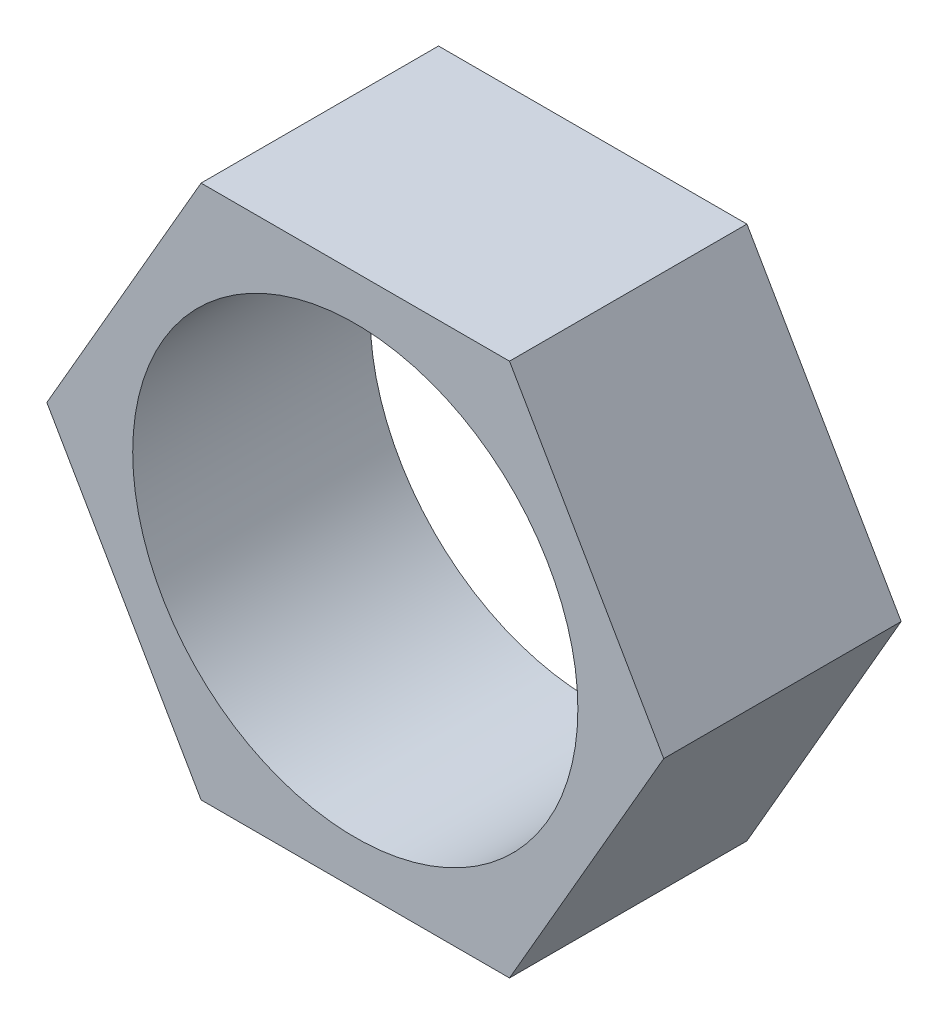
ISO-10303-21;
HEADER;
FILE_DESCRIPTION(('STEP AP214'),'2;1');
FILE_NAME('part.step','',(''),(''),'','','');
FILE_SCHEMA(('AUTOMOTIVE_DESIGN { 1 0 10303 214 1 1 1 1 }'));
ENDSEC;
DATA;
#1=APPLICATION_CONTEXT('core data for automotive mechanical design processes');
#2=APPLICATION_PROTOCOL_DEFINITION('international standard','automotive_design',2000,#1);
#3=PRODUCT_CONTEXT('',#1,'mechanical');
#4=PRODUCT('Part','Part','',(#3));
#5=PRODUCT_RELATED_PRODUCT_CATEGORY('part','',(#4));
#6=PRODUCT_DEFINITION_FORMATION('','',#4);
#7=PRODUCT_DEFINITION_CONTEXT('part definition',#1,'design');
#8=PRODUCT_DEFINITION('design','',#6,#7);
#9=PRODUCT_DEFINITION_SHAPE('','',#8);
#10=(LENGTH_UNIT() NAMED_UNIT(*) SI_UNIT(.MILLI.,.METRE.));
#11=(NAMED_UNIT(*) PLANE_ANGLE_UNIT() SI_UNIT($,.RADIAN.));
#12=(NAMED_UNIT(*) SI_UNIT($,.STERADIAN.) SOLID_ANGLE_UNIT());
#13=UNCERTAINTY_MEASURE_WITH_UNIT(LENGTH_MEASURE(1.E-05),#10,'distance_accuracy_value','');
#14=(GEOMETRIC_REPRESENTATION_CONTEXT(3) GLOBAL_UNCERTAINTY_ASSIGNED_CONTEXT((#13)) GLOBAL_UNIT_ASSIGNED_CONTEXT((#10,
#11,#12)) REPRESENTATION_CONTEXT('',''));
#15=CARTESIAN_POINT('',(0.,0.,0.));
#16=DIRECTION('',(0.,0.,1.));
#17=DIRECTION('',(1.,0.,0.));
#18=AXIS2_PLACEMENT_3D('',#15,#16,#17);
#19=CARTESIAN_POINT('',(51.9615242270663,-90.,80.));
#20=DIRECTION('',(-0.866025403784439,0.5,0.));
#21=DIRECTION('',(-0.5,-0.866025403784439,0.));
#22=AXIS2_PLACEMENT_3D('',#19,#20,#21);
#23=PLANE('',#22);
#24=DIRECTION('',(0.5,0.866025403784439,0.));
#25=VECTOR('',#24,1.);
#26=CARTESIAN_POINT('',(51.9615242270663,-90.,0.));
#27=LINE('',#26,#25);
#28=CARTESIAN_POINT('',(51.9615242270663,-90.,0.));
#29=VERTEX_POINT('',#28);
#30=CARTESIAN_POINT('',(103.923048454133,0.,0.));
#31=VERTEX_POINT('',#30);
#32=EDGE_CURVE('E117',#29,#31,#27,.T.);
#33=ORIENTED_EDGE('',*,*,#32,.T.);
#34=DIRECTION('',(0.,0.,-1.));
#35=VECTOR('',#34,1.);
#36=CARTESIAN_POINT('',(103.923048454133,0.,80.));
#37=LINE('',#36,#35);
#38=CARTESIAN_POINT('',(103.923048454133,0.,80.));
#39=VERTEX_POINT('',#38);
#40=EDGE_CURVE('E11',#39,#31,#37,.T.);
#41=ORIENTED_EDGE('',*,*,#40,.F.);
#42=DIRECTION('',(0.5,0.866025403784439,0.));
#43=VECTOR('',#42,1.);
#44=CARTESIAN_POINT('',(51.9615242270663,-90.,80.));
#45=LINE('',#44,#43);
#46=CARTESIAN_POINT('',(51.9615242270663,-90.,80.));
#47=VERTEX_POINT('',#46);
#48=EDGE_CURVE('E128',#47,#39,#45,.T.);
#49=ORIENTED_EDGE('',*,*,#48,.F.);
#50=DIRECTION('',(0.,0.,-1.));
#51=VECTOR('',#50,1.);
#52=CARTESIAN_POINT('',(51.9615242270663,-90.,80.));
#53=LINE('',#52,#51);
#54=EDGE_CURVE('E113',#47,#29,#53,.T.);
#55=ORIENTED_EDGE('',*,*,#54,.T.);
#56=EDGE_LOOP('',(#33,#41,#49,#55));
#57=FACE_BOUND('',#56,.T.);
#58=ADVANCED_FACE('F33',(#57),#23,.F.);
#59=CARTESIAN_POINT('',(103.923048454133,0.,80.));
#60=DIRECTION('',(-0.866025403784439,-0.5,0.));
#61=DIRECTION('',(0.5,-0.866025403784439,0.));
#62=AXIS2_PLACEMENT_3D('',#59,#60,#61);
#63=PLANE('',#62);
#64=DIRECTION('',(-0.5,0.866025403784439,0.));
#65=VECTOR('',#64,1.);
#66=CARTESIAN_POINT('',(103.923048454133,0.,0.));
#67=LINE('',#66,#65);
#68=CARTESIAN_POINT('',(51.9615242270663,90.,0.));
#69=VERTEX_POINT('',#68);
#70=EDGE_CURVE('E120',#31,#69,#67,.T.);
#71=ORIENTED_EDGE('',*,*,#70,.T.);
#72=DIRECTION('',(0.,0.,-1.));
#73=VECTOR('',#72,1.);
#74=CARTESIAN_POINT('',(51.9615242270663,90.,80.));
#75=LINE('',#74,#73);
#76=CARTESIAN_POINT('',(51.9615242270663,90.,80.));
#77=VERTEX_POINT('',#76);
#78=EDGE_CURVE('E41',#77,#69,#75,.T.);
#79=ORIENTED_EDGE('',*,*,#78,.F.);
#80=DIRECTION('',(-0.5,0.866025403784439,0.));
#81=VECTOR('',#80,1.);
#82=CARTESIAN_POINT('',(103.923048454133,0.,80.));
#83=LINE('',#82,#81);
#84=EDGE_CURVE('E86',#39,#77,#83,.T.);
#85=ORIENTED_EDGE('',*,*,#84,.F.);
#86=ORIENTED_EDGE('',*,*,#40,.T.);
#87=EDGE_LOOP('',(#71,#79,#85,#86));
#88=FACE_BOUND('',#87,.T.);
#89=ADVANCED_FACE('F153',(#88),#63,.F.);
#90=CARTESIAN_POINT('',(51.9615242270663,90.,80.));
#91=DIRECTION('',(0.,-1.,0.));
#92=DIRECTION('',(0.,0.,-1.));
#93=AXIS2_PLACEMENT_3D('',#90,#91,#92);
#94=PLANE('',#93);
#95=DIRECTION('',(-1.,0.,0.));
#96=VECTOR('',#95,1.);
#97=CARTESIAN_POINT('',(51.9615242270663,90.,0.));
#98=LINE('',#97,#96);
#99=CARTESIAN_POINT('',(-51.9615242270663,90.,0.));
#100=VERTEX_POINT('',#99);
#101=EDGE_CURVE('E123',#69,#100,#98,.T.);
#102=ORIENTED_EDGE('',*,*,#101,.T.);
#103=DIRECTION('',(0.,0.,-1.));
#104=VECTOR('',#103,1.);
#105=CARTESIAN_POINT('',(-51.9615242270663,90.,80.));
#106=LINE('',#105,#104);
#107=CARTESIAN_POINT('',(-51.9615242270663,90.,80.));
#108=VERTEX_POINT('',#107);
#109=EDGE_CURVE('E108',#108,#100,#106,.T.);
#110=ORIENTED_EDGE('',*,*,#109,.F.);
#111=DIRECTION('',(-1.,0.,0.));
#112=VECTOR('',#111,1.);
#113=CARTESIAN_POINT('',(51.9615242270663,90.,80.));
#114=LINE('',#113,#112);
#115=EDGE_CURVE('E99',#77,#108,#114,.T.);
#116=ORIENTED_EDGE('',*,*,#115,.F.);
#117=ORIENTED_EDGE('',*,*,#78,.T.);
#118=EDGE_LOOP('',(#102,#110,#116,#117));
#119=FACE_BOUND('',#118,.T.);
#120=ADVANCED_FACE('F134',(#119),#94,.F.);
#121=CARTESIAN_POINT('',(-51.9615242270663,90.,80.));
#122=DIRECTION('',(0.866025403784439,-0.5,0.));
#123=DIRECTION('',(0.5,0.866025403784439,0.));
#124=AXIS2_PLACEMENT_3D('',#121,#122,#123);
#125=PLANE('',#124);
#126=DIRECTION('',(-0.5,-0.866025403784439,0.));
#127=VECTOR('',#126,1.);
#128=CARTESIAN_POINT('',(-51.9615242270663,90.,0.));
#129=LINE('',#128,#127);
#130=CARTESIAN_POINT('',(-103.923048454133,0.,0.));
#131=VERTEX_POINT('',#130);
#132=EDGE_CURVE('E107',#100,#131,#129,.T.);
#133=ORIENTED_EDGE('',*,*,#132,.T.);
#134=DIRECTION('',(0.,0.,-1.));
#135=VECTOR('',#134,1.);
#136=CARTESIAN_POINT('',(-103.923048454133,0.,80.));
#137=LINE('',#136,#135);
#138=CARTESIAN_POINT('',(-103.923048454133,0.,80.));
#139=VERTEX_POINT('',#138);
#140=EDGE_CURVE('E104',#139,#131,#137,.T.);
#141=ORIENTED_EDGE('',*,*,#140,.F.);
#142=DIRECTION('',(-0.5,-0.866025403784439,0.));
#143=VECTOR('',#142,1.);
#144=CARTESIAN_POINT('',(-51.9615242270663,90.,80.));
#145=LINE('',#144,#143);
#146=EDGE_CURVE('E93',#108,#139,#145,.T.);
#147=ORIENTED_EDGE('',*,*,#146,.F.);
#148=ORIENTED_EDGE('',*,*,#109,.T.);
#149=EDGE_LOOP('',(#133,#141,#147,#148));
#150=FACE_BOUND('',#149,.T.);
#151=ADVANCED_FACE('F105',(#150),#125,.F.);
#152=CARTESIAN_POINT('',(-103.923048454133,0.,80.));
#153=DIRECTION('',(0.866025403784439,0.5,0.));
#154=DIRECTION('',(-0.5,0.866025403784439,0.));
#155=AXIS2_PLACEMENT_3D('',#152,#153,#154);
#156=PLANE('',#155);
#157=DIRECTION('',(0.5,-0.866025403784439,0.));
#158=VECTOR('',#157,1.);
#159=CARTESIAN_POINT('',(-103.923048454133,0.,0.));
#160=LINE('',#159,#158);
#161=CARTESIAN_POINT('',(-51.9615242270663,-90.,0.));
#162=VERTEX_POINT('',#161);
#163=EDGE_CURVE('E72',#131,#162,#160,.T.);
#164=ORIENTED_EDGE('',*,*,#163,.T.);
#165=DIRECTION('',(0.,0.,-1.));
#166=VECTOR('',#165,1.);
#167=CARTESIAN_POINT('',(-51.9615242270663,-90.,80.));
#168=LINE('',#167,#166);
#169=CARTESIAN_POINT('',(-51.9615242270663,-90.,80.));
#170=VERTEX_POINT('',#169);
#171=EDGE_CURVE('E109',#170,#162,#168,.T.);
#172=ORIENTED_EDGE('',*,*,#171,.F.);
#173=DIRECTION('',(0.5,-0.866025403784439,0.));
#174=VECTOR('',#173,1.);
#175=CARTESIAN_POINT('',(-103.923048454133,0.,80.));
#176=LINE('',#175,#174);
#177=EDGE_CURVE('E97',#139,#170,#176,.T.);
#178=ORIENTED_EDGE('',*,*,#177,.F.);
#179=ORIENTED_EDGE('',*,*,#140,.T.);
#180=EDGE_LOOP('',(#164,#172,#178,#179));
#181=FACE_BOUND('',#180,.T.);
#182=ADVANCED_FACE('F111',(#181),#156,.F.);
#183=CARTESIAN_POINT('',(-51.9615242270663,-90.,80.));
#184=DIRECTION('',(0.,1.,0.));
#185=DIRECTION('',(-1.,0.,0.));
#186=AXIS2_PLACEMENT_3D('',#183,#184,#185);
#187=PLANE('',#186);
#188=DIRECTION('',(1.,0.,0.));
#189=VECTOR('',#188,1.);
#190=CARTESIAN_POINT('',(-51.9615242270663,-90.,0.));
#191=LINE('',#190,#189);
#192=EDGE_CURVE('E78',#162,#29,#191,.T.);
#193=ORIENTED_EDGE('',*,*,#192,.T.);
#194=ORIENTED_EDGE('',*,*,#54,.F.);
#195=DIRECTION('',(1.,0.,0.));
#196=VECTOR('',#195,1.);
#197=CARTESIAN_POINT('',(-51.9615242270663,-90.,80.));
#198=LINE('',#197,#196);
#199=EDGE_CURVE('E49',#170,#47,#198,.T.);
#200=ORIENTED_EDGE('',*,*,#199,.F.);
#201=ORIENTED_EDGE('',*,*,#171,.T.);
#202=EDGE_LOOP('',(#193,#194,#200,#201));
#203=FACE_BOUND('',#202,.T.);
#204=ADVANCED_FACE('F141',(#203),#187,.F.);
#205=CARTESIAN_POINT('',(0.,0.,80.));
#206=DIRECTION('',(0.,0.,1.));
#207=DIRECTION('',(1.,0.,0.));
#208=AXIS2_PLACEMENT_3D('',#205,#206,#207);
#209=PLANE('',#208);
#210=CARTESIAN_POINT('',(0.,0.,80.));
#211=DIRECTION('',(0.,0.,1.));
#212=DIRECTION('',(1.,0.,0.));
#213=AXIS2_PLACEMENT_3D('',#210,#211,#212);
#214=CIRCLE('',#213,75.);
#215=CARTESIAN_POINT('',(75.,0.,80.));
#216=VERTEX_POINT('',#215);
#217=EDGE_CURVE('E121',#216,#216,#214,.T.);
#218=ORIENTED_EDGE('',*,*,#217,.F.);
#219=EDGE_LOOP('',(#218));
#220=FACE_BOUND('',#219,.T.);
#221=ORIENTED_EDGE('',*,*,#48,.T.);
#222=ORIENTED_EDGE('',*,*,#84,.T.);
#223=ORIENTED_EDGE('',*,*,#115,.T.);
#224=ORIENTED_EDGE('',*,*,#146,.T.);
#225=ORIENTED_EDGE('',*,*,#177,.T.);
#226=ORIENTED_EDGE('',*,*,#199,.T.);
#227=EDGE_LOOP('',(#221,#222,#223,#224,#225,#226));
#228=FACE_BOUND('',#227,.T.);
#229=ADVANCED_FACE('F95',(#220,#228),#209,.T.);
#230=CARTESIAN_POINT('',(0.,0.,0.));
#231=DIRECTION('',(0.,0.,1.));
#232=DIRECTION('',(1.,0.,0.));
#233=AXIS2_PLACEMENT_3D('',#230,#231,#232);
#234=PLANE('',#233);
#235=CARTESIAN_POINT('',(0.,0.,0.));
#236=DIRECTION('',(0.,0.,-1.));
#237=DIRECTION('',(-1.,0.,0.));
#238=AXIS2_PLACEMENT_3D('',#235,#236,#237);
#239=CIRCLE('',#238,75.);
#240=CARTESIAN_POINT('',(-75.,0.,0.));
#241=VERTEX_POINT('',#240);
#242=EDGE_CURVE('E208',#241,#241,#239,.T.);
#243=ORIENTED_EDGE('',*,*,#242,.F.);
#244=EDGE_LOOP('',(#243));
#245=FACE_BOUND('',#244,.T.);
#246=ORIENTED_EDGE('',*,*,#32,.F.);
#247=ORIENTED_EDGE('',*,*,#192,.F.);
#248=ORIENTED_EDGE('',*,*,#163,.F.);
#249=ORIENTED_EDGE('',*,*,#132,.F.);
#250=ORIENTED_EDGE('',*,*,#101,.F.);
#251=ORIENTED_EDGE('',*,*,#70,.F.);
#252=EDGE_LOOP('',(#246,#247,#248,#249,#250,#251));
#253=FACE_BOUND('',#252,.T.);
#254=ADVANCED_FACE('F137',(#245,#253),#234,.F.);
#255=CARTESIAN_POINT('',(0.,0.,134.));
#256=DIRECTION('',(0.,0.,-1.));
#257=DIRECTION('',(-1.,0.,0.));
#258=AXIS2_PLACEMENT_3D('',#255,#256,#257);
#259=CYLINDRICAL_SURFACE('',#258,75.);
#260=ORIENTED_EDGE('',*,*,#217,.T.);
#261=EDGE_LOOP('',(#260));
#262=FACE_BOUND('',#261,.T.);
#263=ORIENTED_EDGE('',*,*,#242,.T.);
#264=EDGE_LOOP('',(#263));
#265=FACE_BOUND('',#264,.T.);
#266=ADVANCED_FACE('F190',(#262,#265),#259,.F.);
#267=CLOSED_SHELL('',(#58,#89,#120,#151,#182,#204,#229,#254,#266));
#268=MANIFOLD_SOLID_BREP('B2',#267);
#269=ADVANCED_BREP_SHAPE_REPRESENTATION('',(#18,#268),#14);
#270=SHAPE_DEFINITION_REPRESENTATION(#9,#269);
ENDSEC;
END-ISO-10303-21;
